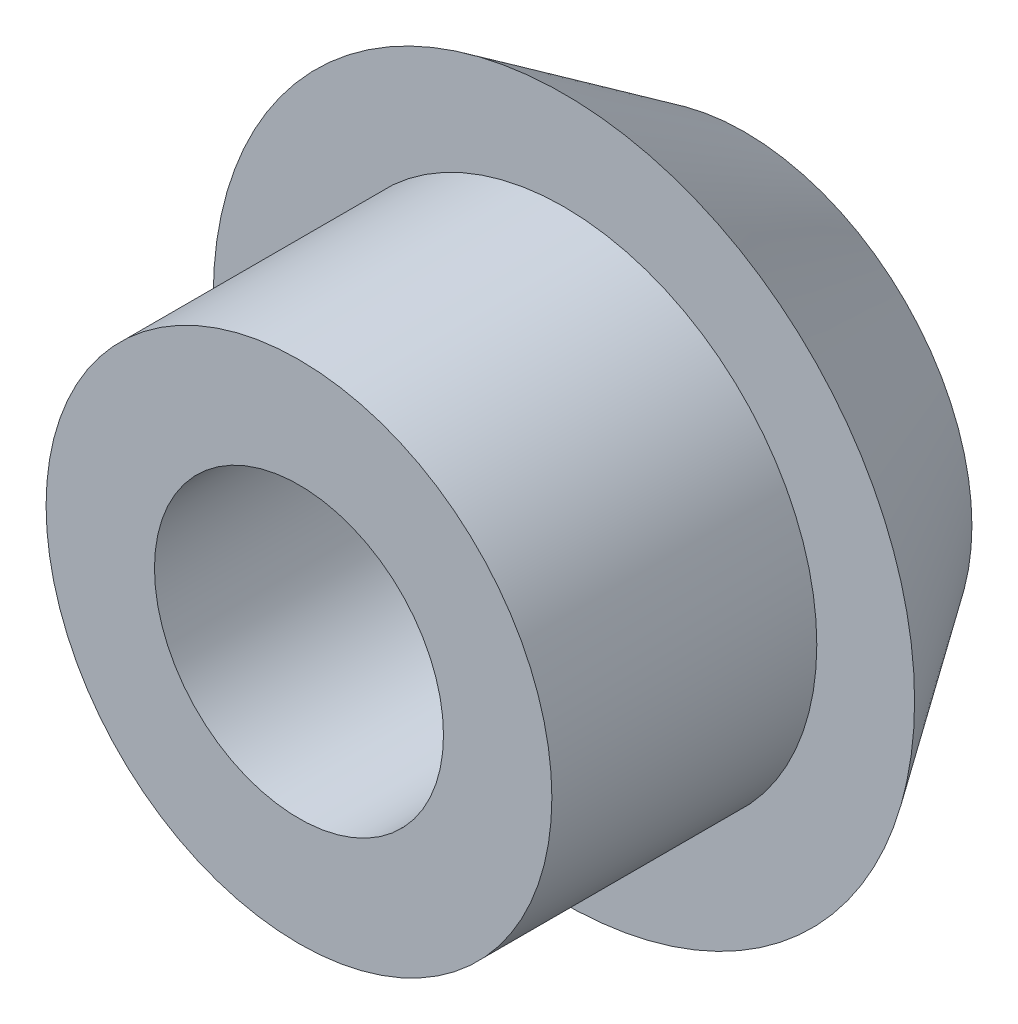
ISO-10303-21;
HEADER;
FILE_DESCRIPTION(('STEP AP214'),'2;1');
FILE_NAME('part.step','',(''),(''),'','','');
FILE_SCHEMA(('AUTOMOTIVE_DESIGN { 1 0 10303 214 1 1 1 1 }'));
ENDSEC;
DATA;
#1=APPLICATION_CONTEXT('core data for automotive mechanical design processes');
#2=APPLICATION_PROTOCOL_DEFINITION('international standard','automotive_design',2000,#1);
#3=PRODUCT_CONTEXT('',#1,'mechanical');
#4=PRODUCT('Part','Part','',(#3));
#5=PRODUCT_RELATED_PRODUCT_CATEGORY('part','',(#4));
#6=PRODUCT_DEFINITION_FORMATION('','',#4);
#7=PRODUCT_DEFINITION_CONTEXT('part definition',#1,'design');
#8=PRODUCT_DEFINITION('design','',#6,#7);
#9=PRODUCT_DEFINITION_SHAPE('','',#8);
#10=(LENGTH_UNIT() NAMED_UNIT(*) SI_UNIT(.MILLI.,.METRE.));
#11=(NAMED_UNIT(*) PLANE_ANGLE_UNIT() SI_UNIT($,.RADIAN.));
#12=(NAMED_UNIT(*) SI_UNIT($,.STERADIAN.) SOLID_ANGLE_UNIT());
#13=UNCERTAINTY_MEASURE_WITH_UNIT(LENGTH_MEASURE(1.E-05),#10,'distance_accuracy_value','');
#14=(GEOMETRIC_REPRESENTATION_CONTEXT(3) GLOBAL_UNCERTAINTY_ASSIGNED_CONTEXT((#13)) GLOBAL_UNIT_ASSIGNED_CONTEXT((#10,
#11,#12)) REPRESENTATION_CONTEXT('',''));
#15=CARTESIAN_POINT('',(0.,0.,0.));
#16=DIRECTION('',(0.,0.,1.));
#17=DIRECTION('',(1.,0.,0.));
#18=AXIS2_PLACEMENT_3D('',#15,#16,#17);
#19=CARTESIAN_POINT('',(7.493,0.,-5.953125));
#20=DIRECTION('',(0.,0.,-1.));
#21=DIRECTION('',(-1.,0.,0.));
#22=AXIS2_PLACEMENT_3D('',#19,#20,#21);
#23=PLANE('',#22);
#24=CARTESIAN_POINT('',(0.,0.,-5.953125));
#25=DIRECTION('',(0.,0.,1.));
#26=DIRECTION('',(1.,0.,0.));
#27=AXIS2_PLACEMENT_3D('',#24,#25,#26);
#28=CIRCLE('',#27,7.493);
#29=CARTESIAN_POINT('',(7.493,0.,-5.953125));
#30=VERTEX_POINT('',#29);
#31=EDGE_CURVE('E35',#30,#30,#28,.T.);
#32=ORIENTED_EDGE('',*,*,#31,.F.);
#33=EDGE_LOOP('',(#32));
#34=FACE_BOUND('',#33,.T.);
#35=CARTESIAN_POINT('',(0.,0.,-5.953125));
#36=DIRECTION('',(0.,0.,-1.));
#37=DIRECTION('',(-1.,0.,0.));
#38=AXIS2_PLACEMENT_3D('',#35,#36,#37);
#39=CIRCLE('',#38,4.7625);
#40=CARTESIAN_POINT('',(-4.7625,0.,-5.953125));
#41=VERTEX_POINT('',#40);
#42=EDGE_CURVE('E19',#41,#41,#39,.F.);
#43=ORIENTED_EDGE('',*,*,#42,.T.);
#44=EDGE_LOOP('',(#43));
#45=FACE_BOUND('',#44,.T.);
#46=ADVANCED_FACE('F16',(#34,#45),#23,.T.);
#47=CARTESIAN_POINT('',(0.,0.,8.73125));
#48=DIRECTION('',(0.,0.,-1.));
#49=DIRECTION('',(-1.,0.,0.));
#50=AXIS2_PLACEMENT_3D('',#47,#48,#49);
#51=CYLINDRICAL_SURFACE('',#50,4.7625);
#52=ORIENTED_EDGE('',*,*,#42,.F.);
#53=EDGE_LOOP('',(#52));
#54=FACE_BOUND('',#53,.T.);
#55=CARTESIAN_POINT('',(0.,0.,8.73125));
#56=DIRECTION('',(0.,0.,-1.));
#57=DIRECTION('',(-1.,0.,0.));
#58=AXIS2_PLACEMENT_3D('',#55,#56,#57);
#59=CIRCLE('',#58,4.7625);
#60=CARTESIAN_POINT('',(-4.7625,0.,8.73125));
#61=VERTEX_POINT('',#60);
#62=EDGE_CURVE('E33',#61,#61,#59,.T.);
#63=ORIENTED_EDGE('',*,*,#62,.F.);
#64=EDGE_LOOP('',(#63));
#65=FACE_BOUND('',#64,.T.);
#66=ADVANCED_FACE('F43',(#54,#65),#51,.F.);
#67=CARTESIAN_POINT('',(0.,0.,0.));
#68=DIRECTION('',(0.,0.,1.));
#69=DIRECTION('',(1.,0.,0.));
#70=AXIS2_PLACEMENT_3D('',#67,#68,#69);
#71=CONICAL_SURFACE('',#70,11.557,0.59899788431541);
#72=ORIENTED_EDGE('',*,*,#31,.T.);
#73=EDGE_LOOP('',(#72));
#74=FACE_BOUND('',#73,.T.);
#75=CARTESIAN_POINT('',(0.,0.,0.));
#76=DIRECTION('',(0.,0.,1.));
#77=DIRECTION('',(1.,0.,0.));
#78=AXIS2_PLACEMENT_3D('',#75,#76,#77);
#79=CIRCLE('',#78,11.557);
#80=CARTESIAN_POINT('',(11.557,0.,0.));
#81=VERTEX_POINT('',#80);
#82=EDGE_CURVE('E28',#81,#81,#79,.T.);
#83=ORIENTED_EDGE('',*,*,#82,.F.);
#84=EDGE_LOOP('',(#83));
#85=FACE_BOUND('',#84,.T.);
#86=ADVANCED_FACE('F46',(#74,#85),#71,.T.);
#87=CARTESIAN_POINT('',(0.,0.,8.73125));
#88=DIRECTION('',(0.,0.,1.));
#89=DIRECTION('',(1.,0.,0.));
#90=AXIS2_PLACEMENT_3D('',#87,#88,#89);
#91=PLANE('',#90);
#92=CARTESIAN_POINT('',(0.,0.,8.73125));
#93=DIRECTION('',(0.,0.,-1.));
#94=DIRECTION('',(-1.,0.,0.));
#95=AXIS2_PLACEMENT_3D('',#92,#93,#94);
#96=CIRCLE('',#95,8.334375);
#97=CARTESIAN_POINT('',(-8.334375,0.,8.73125));
#98=VERTEX_POINT('',#97);
#99=EDGE_CURVE('E23',#98,#98,#96,.T.);
#100=ORIENTED_EDGE('',*,*,#99,.F.);
#101=EDGE_LOOP('',(#100));
#102=FACE_BOUND('',#101,.T.);
#103=ORIENTED_EDGE('',*,*,#62,.T.);
#104=EDGE_LOOP('',(#103));
#105=FACE_BOUND('',#104,.T.);
#106=ADVANCED_FACE('F49',(#102,#105),#91,.T.);
#107=CARTESIAN_POINT('',(0.,0.,0.));
#108=DIRECTION('',(0.,0.,1.));
#109=DIRECTION('',(1.,0.,0.));
#110=AXIS2_PLACEMENT_3D('',#107,#108,#109);
#111=PLANE('',#110);
#112=CARTESIAN_POINT('',(0.,0.,0.));
#113=DIRECTION('',(0.,0.,-1.));
#114=DIRECTION('',(-1.,0.,0.));
#115=AXIS2_PLACEMENT_3D('',#112,#113,#114);
#116=CIRCLE('',#115,8.334375);
#117=CARTESIAN_POINT('',(-8.334375,0.,0.));
#118=VERTEX_POINT('',#117);
#119=EDGE_CURVE('E10',#118,#118,#116,.F.);
#120=ORIENTED_EDGE('',*,*,#119,.F.);
#121=EDGE_LOOP('',(#120));
#122=FACE_BOUND('',#121,.T.);
#123=ORIENTED_EDGE('',*,*,#82,.T.);
#124=EDGE_LOOP('',(#123));
#125=FACE_BOUND('',#124,.T.);
#126=ADVANCED_FACE('F51',(#122,#125),#111,.T.);
#127=CARTESIAN_POINT('',(0.,0.,8.73125));
#128=DIRECTION('',(0.,0.,-1.));
#129=DIRECTION('',(-1.,0.,0.));
#130=AXIS2_PLACEMENT_3D('',#127,#128,#129);
#131=CYLINDRICAL_SURFACE('',#130,8.334375);
#132=ORIENTED_EDGE('',*,*,#119,.T.);
#133=EDGE_LOOP('',(#132));
#134=FACE_BOUND('',#133,.T.);
#135=ORIENTED_EDGE('',*,*,#99,.T.);
#136=EDGE_LOOP('',(#135));
#137=FACE_BOUND('',#136,.T.);
#138=ADVANCED_FACE('F59',(#134,#137),#131,.T.);
#139=CLOSED_SHELL('',(#46,#66,#86,#106,#126,#138));
#140=MANIFOLD_SOLID_BREP('B1',#139);
#141=ADVANCED_BREP_SHAPE_REPRESENTATION('',(#18,#140),#14);
#142=SHAPE_DEFINITION_REPRESENTATION(#9,#141);
ENDSEC;
END-ISO-10303-21;
